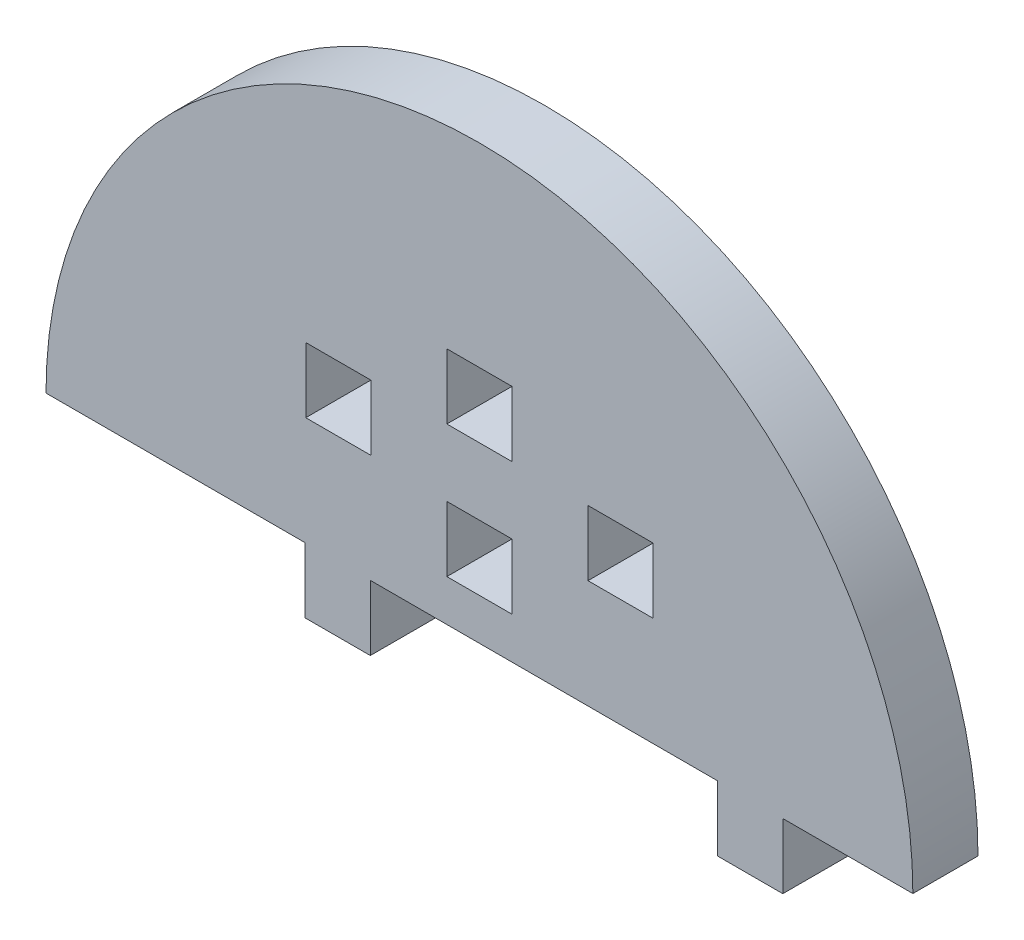
ISO-10303-21;
HEADER;
FILE_DESCRIPTION(('STEP AP214'),'2;1');
FILE_NAME('part.step','',(''),(''),'','','');
FILE_SCHEMA(('AUTOMOTIVE_DESIGN { 1 0 10303 214 1 1 1 1 }'));
ENDSEC;
DATA;
#1=APPLICATION_CONTEXT('core data for automotive mechanical design processes');
#2=APPLICATION_PROTOCOL_DEFINITION('international standard','automotive_design',2000,#1);
#3=PRODUCT_CONTEXT('',#1,'mechanical');
#4=PRODUCT('Part','Part','',(#3));
#5=PRODUCT_RELATED_PRODUCT_CATEGORY('part','',(#4));
#6=PRODUCT_DEFINITION_FORMATION('','',#4);
#7=PRODUCT_DEFINITION_CONTEXT('part definition',#1,'design');
#8=PRODUCT_DEFINITION('design','',#6,#7);
#9=PRODUCT_DEFINITION_SHAPE('','',#8);
#10=(LENGTH_UNIT() NAMED_UNIT(*) SI_UNIT(.MILLI.,.METRE.));
#11=(NAMED_UNIT(*) PLANE_ANGLE_UNIT() SI_UNIT($,.RADIAN.));
#12=(NAMED_UNIT(*) SI_UNIT($,.STERADIAN.) SOLID_ANGLE_UNIT());
#13=UNCERTAINTY_MEASURE_WITH_UNIT(LENGTH_MEASURE(1.E-05),#10,'distance_accuracy_value','');
#14=(GEOMETRIC_REPRESENTATION_CONTEXT(3) GLOBAL_UNCERTAINTY_ASSIGNED_CONTEXT((#13)) GLOBAL_UNIT_ASSIGNED_CONTEXT((#10,
#11,#12)) REPRESENTATION_CONTEXT('',''));
#15=CARTESIAN_POINT('',(0.,0.,0.));
#16=DIRECTION('',(0.,0.,1.));
#17=DIRECTION('',(1.,0.,0.));
#18=AXIS2_PLACEMENT_3D('',#15,#16,#17);
#19=CARTESIAN_POINT('',(3528.3356839371,1061.74894743644,6.));
#20=DIRECTION('',(0.,0.,1.));
#21=DIRECTION('',(1.,0.,0.));
#22=AXIS2_PLACEMENT_3D('',#19,#20,#21);
#23=PLANE('',#22);
#24=DIRECTION('',(0.,1.,0.));
#25=VECTOR('',#24,1.);
#26=CARTESIAN_POINT('',(3538.3356839371,0.,6.));
#27=LINE('',#26,#25);
#28=CARTESIAN_POINT('',(3538.3356839371,1071.74894743644,6.));
#29=VERTEX_POINT('',#28);
#30=CARTESIAN_POINT('',(3538.3356839371,1077.74894743644,6.));
#31=VERTEX_POINT('',#30);
#32=EDGE_CURVE('E429',#29,#31,#27,.T.);
#33=ORIENTED_EDGE('',*,*,#32,.T.);
#34=DIRECTION('',(1.,0.,0.));
#35=VECTOR('',#34,1.);
#36=CARTESIAN_POINT('',(0.,1077.74894743644,6.));
#37=LINE('',#36,#35);
#38=CARTESIAN_POINT('',(3544.3356839371,1077.74894743644,6.));
#39=VERTEX_POINT('',#38);
#40=EDGE_CURVE('E442',#31,#39,#37,.T.);
#41=ORIENTED_EDGE('',*,*,#40,.T.);
#42=DIRECTION('',(0.,-1.,0.));
#43=VECTOR('',#42,1.);
#44=CARTESIAN_POINT('',(3544.3356839371,0.,6.));
#45=LINE('',#44,#43);
#46=CARTESIAN_POINT('',(3544.3356839371,1071.74894743644,6.));
#47=VERTEX_POINT('',#46);
#48=EDGE_CURVE('E438',#39,#47,#45,.T.);
#49=ORIENTED_EDGE('',*,*,#48,.T.);
#50=DIRECTION('',(-1.,0.,0.));
#51=VECTOR('',#50,1.);
#52=CARTESIAN_POINT('',(0.,1071.74894743644,6.));
#53=LINE('',#52,#51);
#54=EDGE_CURVE('E433',#47,#29,#53,.T.);
#55=ORIENTED_EDGE('',*,*,#54,.T.);
#56=EDGE_LOOP('',(#33,#41,#49,#55));
#57=FACE_BOUND('',#56,.T.);
#58=DIRECTION('',(0.,1.,0.));
#59=VECTOR('',#58,1.);
#60=CARTESIAN_POINT('',(3525.3356839371,0.,6.));
#61=LINE('',#60,#59);
#62=CARTESIAN_POINT('',(3525.3356839371,1077.74894743644,6.));
#63=VERTEX_POINT('',#62);
#64=CARTESIAN_POINT('',(3525.3356839371,1083.74894743644,6.));
#65=VERTEX_POINT('',#64);
#66=EDGE_CURVE('E516',#63,#65,#61,.T.);
#67=ORIENTED_EDGE('',*,*,#66,.T.);
#68=DIRECTION('',(1.,0.,0.));
#69=VECTOR('',#68,1.);
#70=CARTESIAN_POINT('',(0.,1083.74894743644,6.));
#71=LINE('',#70,#69);
#72=CARTESIAN_POINT('',(3531.3356839371,1083.74894743644,6.));
#73=VERTEX_POINT('',#72);
#74=EDGE_CURVE('E529',#65,#73,#71,.T.);
#75=ORIENTED_EDGE('',*,*,#74,.T.);
#76=DIRECTION('',(0.,-1.,0.));
#77=VECTOR('',#76,1.);
#78=CARTESIAN_POINT('',(3531.3356839371,0.,6.));
#79=LINE('',#78,#77);
#80=CARTESIAN_POINT('',(3531.3356839371,1077.74894743644,6.));
#81=VERTEX_POINT('',#80);
#82=EDGE_CURVE('E525',#73,#81,#79,.T.);
#83=ORIENTED_EDGE('',*,*,#82,.T.);
#84=DIRECTION('',(-1.,0.,0.));
#85=VECTOR('',#84,1.);
#86=CARTESIAN_POINT('',(0.,1077.74894743644,6.));
#87=LINE('',#86,#85);
#88=EDGE_CURVE('E520',#81,#63,#87,.T.);
#89=ORIENTED_EDGE('',*,*,#88,.T.);
#90=EDGE_LOOP('',(#67,#75,#83,#89));
#91=FACE_BOUND('',#90,.T.);
#92=DIRECTION('',(1.,0.,0.));
#93=VECTOR('',#92,1.);
#94=CARTESIAN_POINT('',(3556.28431890895,1061.74894743644,6.));
#95=LINE('',#94,#93);
#96=CARTESIAN_POINT('',(3556.28431890895,1061.74894743644,6.));
#97=VERTEX_POINT('',#96);
#98=CARTESIAN_POINT('',(3568.26425536569,1061.74894743644,6.));
#99=VERTEX_POINT('',#98);
#100=EDGE_CURVE('E560',#97,#99,#95,.T.);
#101=ORIENTED_EDGE('',*,*,#100,.T.);
#102=CARTESIAN_POINT('',(3528.3356839371,1061.74894743644,6.));
#103=DIRECTION('',(0.,0.,1.));
#104=DIRECTION('',(1.,0.,0.));
#105=AXIS2_PLACEMENT_3D('',#102,#103,#104);
#106=CIRCLE('',#105,39.9285714285824);
#107=CARTESIAN_POINT('',(3488.40711250852,1061.74894743644,6.));
#108=VERTEX_POINT('',#107);
#109=EDGE_CURVE('E564',#99,#108,#106,.T.);
#110=ORIENTED_EDGE('',*,*,#109,.T.);
#111=DIRECTION('',(1.,0.,0.));
#112=VECTOR('',#111,1.);
#113=CARTESIAN_POINT('',(3488.40711250852,1061.74894743644,6.));
#114=LINE('',#113,#112);
#115=CARTESIAN_POINT('',(3512.28431890895,1061.74894743644,6.));
#116=VERTEX_POINT('',#115);
#117=EDGE_CURVE('E568',#108,#116,#114,.T.);
#118=ORIENTED_EDGE('',*,*,#117,.T.);
#119=DIRECTION('',(0.,1.,0.));
#120=VECTOR('',#119,1.);
#121=CARTESIAN_POINT('',(3512.28431890895,1055.74894743644,6.));
#122=LINE('',#121,#120);
#123=CARTESIAN_POINT('',(3512.28431890895,1055.74894743644,6.));
#124=VERTEX_POINT('',#123);
#125=EDGE_CURVE('E571',#124,#116,#122,.T.);
#126=ORIENTED_EDGE('',*,*,#125,.F.);
#127=DIRECTION('',(-1.,0.,0.));
#128=VECTOR('',#127,1.);
#129=CARTESIAN_POINT('',(3518.28431890895,1055.74894743644,6.));
#130=LINE('',#129,#128);
#131=CARTESIAN_POINT('',(3518.28431890895,1055.74894743644,6.));
#132=VERTEX_POINT('',#131);
#133=EDGE_CURVE('E575',#132,#124,#130,.T.);
#134=ORIENTED_EDGE('',*,*,#133,.F.);
#135=DIRECTION('',(0.,-1.,0.));
#136=VECTOR('',#135,1.);
#137=CARTESIAN_POINT('',(3518.28431890895,1061.74894743644,6.));
#138=LINE('',#137,#136);
#139=CARTESIAN_POINT('',(3518.28431890895,1061.74894743644,6.));
#140=VERTEX_POINT('',#139);
#141=EDGE_CURVE('E579',#140,#132,#138,.T.);
#142=ORIENTED_EDGE('',*,*,#141,.F.);
#143=DIRECTION('',(1.,0.,0.));
#144=VECTOR('',#143,1.);
#145=CARTESIAN_POINT('',(3518.28431890895,1061.74894743644,6.));
#146=LINE('',#145,#144);
#147=CARTESIAN_POINT('',(3550.28431890895,1061.74894743644,6.));
#148=VERTEX_POINT('',#147);
#149=EDGE_CURVE('E583',#140,#148,#146,.T.);
#150=ORIENTED_EDGE('',*,*,#149,.T.);
#151=DIRECTION('',(0.,-1.,0.));
#152=VECTOR('',#151,1.);
#153=CARTESIAN_POINT('',(3550.28431890895,1061.74894743644,6.));
#154=LINE('',#153,#152);
#155=CARTESIAN_POINT('',(3550.28431890895,1055.74894743644,6.));
#156=VERTEX_POINT('',#155);
#157=EDGE_CURVE('E586',#148,#156,#154,.T.);
#158=ORIENTED_EDGE('',*,*,#157,.T.);
#159=DIRECTION('',(1.,0.,0.));
#160=VECTOR('',#159,1.);
#161=CARTESIAN_POINT('',(3550.28431890895,1055.74894743644,6.));
#162=LINE('',#161,#160);
#163=CARTESIAN_POINT('',(3556.28431890895,1055.74894743644,6.));
#164=VERTEX_POINT('',#163);
#165=EDGE_CURVE('E589',#156,#164,#162,.T.);
#166=ORIENTED_EDGE('',*,*,#165,.T.);
#167=DIRECTION('',(0.,1.,0.));
#168=VECTOR('',#167,1.);
#169=CARTESIAN_POINT('',(3556.28431890895,1055.74894743644,6.));
#170=LINE('',#169,#168);
#171=EDGE_CURVE('E592',#164,#97,#170,.T.);
#172=ORIENTED_EDGE('',*,*,#171,.T.);
#173=EDGE_LOOP('',(#101,#110,#118,#126,#134,#142,#150,#158,#166,#172));
#174=FACE_BOUND('',#173,.T.);
#175=DIRECTION('',(0.,-1.,0.));
#176=VECTOR('',#175,1.);
#177=CARTESIAN_POINT('',(3525.3356839371,0.,6.));
#178=LINE('',#177,#176);
#179=CARTESIAN_POINT('',(3525.3356839371,1071.57340626986,6.));
#180=VERTEX_POINT('',#179);
#181=CARTESIAN_POINT('',(3525.3356839371,1065.57340626986,6.));
#182=VERTEX_POINT('',#181);
#183=EDGE_CURVE('E476',#180,#182,#178,.T.);
#184=ORIENTED_EDGE('',*,*,#183,.F.);
#185=DIRECTION('',(-1.,0.,0.));
#186=VECTOR('',#185,1.);
#187=CARTESIAN_POINT('',(0.,1071.57340626986,6.));
#188=LINE('',#187,#186);
#189=CARTESIAN_POINT('',(3531.3356839371,1071.57340626986,6.));
#190=VERTEX_POINT('',#189);
#191=EDGE_CURVE('E473',#190,#180,#188,.T.);
#192=ORIENTED_EDGE('',*,*,#191,.F.);
#193=DIRECTION('',(0.,1.,0.));
#194=VECTOR('',#193,1.);
#195=CARTESIAN_POINT('',(3531.3356839371,0.,6.));
#196=LINE('',#195,#194);
#197=CARTESIAN_POINT('',(3531.3356839371,1065.57340626986,6.));
#198=VERTEX_POINT('',#197);
#199=EDGE_CURVE('E484',#198,#190,#196,.T.);
#200=ORIENTED_EDGE('',*,*,#199,.F.);
#201=DIRECTION('',(1.,0.,0.));
#202=VECTOR('',#201,1.);
#203=CARTESIAN_POINT('',(0.,1065.57340626986,6.));
#204=LINE('',#203,#202);
#205=EDGE_CURVE('E480',#182,#198,#204,.T.);
#206=ORIENTED_EDGE('',*,*,#205,.F.);
#207=EDGE_LOOP('',(#184,#192,#200,#206));
#208=FACE_BOUND('',#207,.T.);
#209=DIRECTION('',(0.,-1.,0.));
#210=VECTOR('',#209,1.);
#211=CARTESIAN_POINT('',(3512.3356839371,1077.74894743644,6.));
#212=LINE('',#211,#210);
#213=CARTESIAN_POINT('',(3512.3356839371,1077.74894743644,6.));
#214=VERTEX_POINT('',#213);
#215=CARTESIAN_POINT('',(3512.3356839371,1071.74894743644,6.));
#216=VERTEX_POINT('',#215);
#217=EDGE_CURVE('E390',#214,#216,#212,.T.);
#218=ORIENTED_EDGE('',*,*,#217,.F.);
#219=DIRECTION('',(-1.,0.,0.));
#220=VECTOR('',#219,1.);
#221=CARTESIAN_POINT('',(3518.3356839371,1077.74894743644,6.));
#222=LINE('',#221,#220);
#223=CARTESIAN_POINT('',(3518.3356839371,1077.74894743644,6.));
#224=VERTEX_POINT('',#223);
#225=EDGE_CURVE('E381',#224,#214,#222,.T.);
#226=ORIENTED_EDGE('',*,*,#225,.F.);
#227=DIRECTION('',(0.,1.,0.));
#228=VECTOR('',#227,1.);
#229=CARTESIAN_POINT('',(3518.3356839371,1071.74894743644,6.));
#230=LINE('',#229,#228);
#231=CARTESIAN_POINT('',(3518.3356839371,1071.74894743644,6.));
#232=VERTEX_POINT('',#231);
#233=EDGE_CURVE('E407',#232,#224,#230,.T.);
#234=ORIENTED_EDGE('',*,*,#233,.F.);
#235=DIRECTION('',(1.,0.,0.));
#236=VECTOR('',#235,1.);
#237=CARTESIAN_POINT('',(3512.3356839371,1071.74894743644,6.));
#238=LINE('',#237,#236);
#239=EDGE_CURVE('E403',#216,#232,#238,.T.);
#240=ORIENTED_EDGE('',*,*,#239,.F.);
#241=EDGE_LOOP('',(#218,#226,#234,#240));
#242=FACE_BOUND('',#241,.T.);
#243=ADVANCED_FACE('F207',(#57,#91,#174,#208,#242),#23,.T.);
#244=CARTESIAN_POINT('',(3528.3356839371,1061.74894743644,0.));
#245=DIRECTION('',(0.,0.,1.));
#246=DIRECTION('',(1.,0.,0.));
#247=AXIS2_PLACEMENT_3D('',#244,#245,#246);
#248=PLANE('',#247);
#249=DIRECTION('',(-1.,0.,0.));
#250=VECTOR('',#249,1.);
#251=CARTESIAN_POINT('',(0.,1071.57340626986,0.));
#252=LINE('',#251,#250);
#253=CARTESIAN_POINT('',(3531.3356839371,1071.57340626986,0.));
#254=VERTEX_POINT('',#253);
#255=CARTESIAN_POINT('',(3525.3356839371,1071.57340626986,0.));
#256=VERTEX_POINT('',#255);
#257=EDGE_CURVE('E472',#254,#256,#252,.T.);
#258=ORIENTED_EDGE('',*,*,#257,.T.);
#259=DIRECTION('',(0.,-1.,0.));
#260=VECTOR('',#259,1.);
#261=CARTESIAN_POINT('',(3525.3356839371,0.,0.));
#262=LINE('',#261,#260);
#263=CARTESIAN_POINT('',(3525.3356839371,1065.57340626986,0.));
#264=VERTEX_POINT('',#263);
#265=EDGE_CURVE('E491',#256,#264,#262,.T.);
#266=ORIENTED_EDGE('',*,*,#265,.T.);
#267=DIRECTION('',(1.,0.,0.));
#268=VECTOR('',#267,1.);
#269=CARTESIAN_POINT('',(0.,1065.57340626986,0.));
#270=LINE('',#269,#268);
#271=CARTESIAN_POINT('',(3531.3356839371,1065.57340626986,0.));
#272=VERTEX_POINT('',#271);
#273=EDGE_CURVE('E495',#264,#272,#270,.T.);
#274=ORIENTED_EDGE('',*,*,#273,.T.);
#275=DIRECTION('',(0.,1.,0.));
#276=VECTOR('',#275,1.);
#277=CARTESIAN_POINT('',(3531.3356839371,0.,0.));
#278=LINE('',#277,#276);
#279=EDGE_CURVE('E477',#272,#254,#278,.T.);
#280=ORIENTED_EDGE('',*,*,#279,.T.);
#281=EDGE_LOOP('',(#258,#266,#274,#280));
#282=FACE_BOUND('',#281,.T.);
#283=DIRECTION('',(1.,0.,0.));
#284=VECTOR('',#283,1.);
#285=CARTESIAN_POINT('',(0.,1083.74894743644,0.));
#286=LINE('',#285,#284);
#287=CARTESIAN_POINT('',(3525.3356839371,1083.74894743644,0.));
#288=VERTEX_POINT('',#287);
#289=CARTESIAN_POINT('',(3531.3356839371,1083.74894743644,0.));
#290=VERTEX_POINT('',#289);
#291=EDGE_CURVE('E521',#288,#290,#286,.T.);
#292=ORIENTED_EDGE('',*,*,#291,.F.);
#293=DIRECTION('',(0.,1.,0.));
#294=VECTOR('',#293,1.);
#295=CARTESIAN_POINT('',(3525.3356839371,0.,0.));
#296=LINE('',#295,#294);
#297=CARTESIAN_POINT('',(3525.3356839371,1077.74894743644,0.));
#298=VERTEX_POINT('',#297);
#299=EDGE_CURVE('E515',#298,#288,#296,.T.);
#300=ORIENTED_EDGE('',*,*,#299,.F.);
#301=DIRECTION('',(-1.,0.,0.));
#302=VECTOR('',#301,1.);
#303=CARTESIAN_POINT('',(0.,1077.74894743644,0.));
#304=LINE('',#303,#302);
#305=CARTESIAN_POINT('',(3531.3356839371,1077.74894743644,0.));
#306=VERTEX_POINT('',#305);
#307=EDGE_CURVE('E536',#306,#298,#304,.T.);
#308=ORIENTED_EDGE('',*,*,#307,.F.);
#309=DIRECTION('',(0.,-1.,0.));
#310=VECTOR('',#309,1.);
#311=CARTESIAN_POINT('',(3531.3356839371,0.,0.));
#312=LINE('',#311,#310);
#313=EDGE_CURVE('E540',#290,#306,#312,.T.);
#314=ORIENTED_EDGE('',*,*,#313,.F.);
#315=EDGE_LOOP('',(#292,#300,#308,#314));
#316=FACE_BOUND('',#315,.T.);
#317=DIRECTION('',(1.,0.,0.));
#318=VECTOR('',#317,1.);
#319=CARTESIAN_POINT('',(3556.28431890895,1061.74894743644,0.));
#320=LINE('',#319,#318);
#321=CARTESIAN_POINT('',(3556.28431890895,1061.74894743644,0.));
#322=VERTEX_POINT('',#321);
#323=CARTESIAN_POINT('',(3568.26425536569,1061.74894743644,0.));
#324=VERTEX_POINT('',#323);
#325=EDGE_CURVE('E559',#322,#324,#320,.T.);
#326=ORIENTED_EDGE('',*,*,#325,.F.);
#327=DIRECTION('',(0.,1.,0.));
#328=VECTOR('',#327,1.);
#329=CARTESIAN_POINT('',(3556.28431890895,1055.74894743644,0.));
#330=LINE('',#329,#328);
#331=CARTESIAN_POINT('',(3556.28431890895,1055.74894743644,0.));
#332=VERTEX_POINT('',#331);
#333=EDGE_CURVE('E565',#332,#322,#330,.T.);
#334=ORIENTED_EDGE('',*,*,#333,.F.);
#335=DIRECTION('',(1.,0.,0.));
#336=VECTOR('',#335,1.);
#337=CARTESIAN_POINT('',(3550.28431890895,1055.74894743644,0.));
#338=LINE('',#337,#336);
#339=CARTESIAN_POINT('',(3550.28431890895,1055.74894743644,0.));
#340=VERTEX_POINT('',#339);
#341=EDGE_CURVE('E624',#340,#332,#338,.T.);
#342=ORIENTED_EDGE('',*,*,#341,.F.);
#343=DIRECTION('',(0.,-1.,0.));
#344=VECTOR('',#343,1.);
#345=CARTESIAN_POINT('',(3550.28431890895,1061.74894743644,0.));
#346=LINE('',#345,#344);
#347=CARTESIAN_POINT('',(3550.28431890895,1061.74894743644,0.));
#348=VERTEX_POINT('',#347);
#349=EDGE_CURVE('E621',#348,#340,#346,.T.);
#350=ORIENTED_EDGE('',*,*,#349,.F.);
#351=DIRECTION('',(1.,0.,0.));
#352=VECTOR('',#351,1.);
#353=CARTESIAN_POINT('',(3518.28431890895,1061.74894743644,0.));
#354=LINE('',#353,#352);
#355=CARTESIAN_POINT('',(3518.28431890895,1061.74894743644,0.));
#356=VERTEX_POINT('',#355);
#357=EDGE_CURVE('E618',#356,#348,#354,.T.);
#358=ORIENTED_EDGE('',*,*,#357,.F.);
#359=DIRECTION('',(0.,-1.,0.));
#360=VECTOR('',#359,1.);
#361=CARTESIAN_POINT('',(3518.28431890895,1061.74894743644,0.));
#362=LINE('',#361,#360);
#363=CARTESIAN_POINT('',(3518.28431890895,1055.74894743644,0.));
#364=VERTEX_POINT('',#363);
#365=EDGE_CURVE('E614',#356,#364,#362,.T.);
#366=ORIENTED_EDGE('',*,*,#365,.T.);
#367=DIRECTION('',(-1.,0.,0.));
#368=VECTOR('',#367,1.);
#369=CARTESIAN_POINT('',(3518.28431890895,1055.74894743644,0.));
#370=LINE('',#369,#368);
#371=CARTESIAN_POINT('',(3512.28431890895,1055.74894743644,0.));
#372=VERTEX_POINT('',#371);
#373=EDGE_CURVE('E610',#364,#372,#370,.T.);
#374=ORIENTED_EDGE('',*,*,#373,.T.);
#375=DIRECTION('',(0.,1.,0.));
#376=VECTOR('',#375,1.);
#377=CARTESIAN_POINT('',(3512.28431890895,1055.74894743644,0.));
#378=LINE('',#377,#376);
#379=CARTESIAN_POINT('',(3512.28431890895,1061.74894743644,0.));
#380=VERTEX_POINT('',#379);
#381=EDGE_CURVE('E606',#372,#380,#378,.T.);
#382=ORIENTED_EDGE('',*,*,#381,.T.);
#383=DIRECTION('',(1.,0.,0.));
#384=VECTOR('',#383,1.);
#385=CARTESIAN_POINT('',(3488.40711250852,1061.74894743644,0.));
#386=LINE('',#385,#384);
#387=CARTESIAN_POINT('',(3488.40711250852,1061.74894743644,0.));
#388=VERTEX_POINT('',#387);
#389=EDGE_CURVE('E602',#388,#380,#386,.T.);
#390=ORIENTED_EDGE('',*,*,#389,.F.);
#391=CARTESIAN_POINT('',(3528.3356839371,1061.74894743644,0.));
#392=DIRECTION('',(0.,0.,1.));
#393=DIRECTION('',(1.,0.,0.));
#394=AXIS2_PLACEMENT_3D('',#391,#392,#393);
#395=CIRCLE('',#394,39.9285714285824);
#396=EDGE_CURVE('E599',#324,#388,#395,.T.);
#397=ORIENTED_EDGE('',*,*,#396,.F.);
#398=EDGE_LOOP('',(#326,#334,#342,#350,#358,#366,#374,#382,#390,#397));
#399=FACE_BOUND('',#398,.T.);
#400=DIRECTION('',(1.,0.,0.));
#401=VECTOR('',#400,1.);
#402=CARTESIAN_POINT('',(0.,1077.74894743644,0.));
#403=LINE('',#402,#401);
#404=CARTESIAN_POINT('',(3538.3356839371,1077.74894743644,0.));
#405=VERTEX_POINT('',#404);
#406=CARTESIAN_POINT('',(3544.3356839371,1077.74894743644,0.));
#407=VERTEX_POINT('',#406);
#408=EDGE_CURVE('E434',#405,#407,#403,.T.);
#409=ORIENTED_EDGE('',*,*,#408,.F.);
#410=DIRECTION('',(0.,1.,0.));
#411=VECTOR('',#410,1.);
#412=CARTESIAN_POINT('',(3538.3356839371,0.,0.));
#413=LINE('',#412,#411);
#414=CARTESIAN_POINT('',(3538.3356839371,1071.74894743644,0.));
#415=VERTEX_POINT('',#414);
#416=EDGE_CURVE('E399',#415,#405,#413,.T.);
#417=ORIENTED_EDGE('',*,*,#416,.F.);
#418=DIRECTION('',(-1.,0.,0.));
#419=VECTOR('',#418,1.);
#420=CARTESIAN_POINT('',(0.,1071.74894743644,0.));
#421=LINE('',#420,#419);
#422=CARTESIAN_POINT('',(3544.3356839371,1071.74894743644,0.));
#423=VERTEX_POINT('',#422);
#424=EDGE_CURVE('E449',#423,#415,#421,.T.);
#425=ORIENTED_EDGE('',*,*,#424,.F.);
#426=DIRECTION('',(0.,-1.,0.));
#427=VECTOR('',#426,1.);
#428=CARTESIAN_POINT('',(3544.3356839371,0.,0.));
#429=LINE('',#428,#427);
#430=EDGE_CURVE('E453',#407,#423,#429,.T.);
#431=ORIENTED_EDGE('',*,*,#430,.F.);
#432=EDGE_LOOP('',(#409,#417,#425,#431));
#433=FACE_BOUND('',#432,.T.);
#434=DIRECTION('',(-1.,0.,0.));
#435=VECTOR('',#434,1.);
#436=CARTESIAN_POINT('',(3518.3356839371,1077.74894743644,0.));
#437=LINE('',#436,#435);
#438=CARTESIAN_POINT('',(3518.3356839371,1077.74894743644,0.));
#439=VERTEX_POINT('',#438);
#440=CARTESIAN_POINT('',(3512.3356839371,1077.74894743644,0.));
#441=VERTEX_POINT('',#440);
#442=EDGE_CURVE('E231',#439,#441,#437,.T.);
#443=ORIENTED_EDGE('',*,*,#442,.T.);
#444=DIRECTION('',(0.,-1.,0.));
#445=VECTOR('',#444,1.);
#446=CARTESIAN_POINT('',(3512.3356839371,1077.74894743644,0.));
#447=LINE('',#446,#445);
#448=CARTESIAN_POINT('',(3512.3356839371,1071.74894743644,0.));
#449=VERTEX_POINT('',#448);
#450=EDGE_CURVE('E397',#441,#449,#447,.T.);
#451=ORIENTED_EDGE('',*,*,#450,.T.);
#452=DIRECTION('',(1.,0.,0.));
#453=VECTOR('',#452,1.);
#454=CARTESIAN_POINT('',(3512.3356839371,1071.74894743644,0.));
#455=LINE('',#454,#453);
#456=CARTESIAN_POINT('',(3518.3356839371,1071.74894743644,0.));
#457=VERTEX_POINT('',#456);
#458=EDGE_CURVE('E416',#449,#457,#455,.T.);
#459=ORIENTED_EDGE('',*,*,#458,.T.);
#460=DIRECTION('',(0.,1.,0.));
#461=VECTOR('',#460,1.);
#462=CARTESIAN_POINT('',(3518.3356839371,1071.74894743644,0.));
#463=LINE('',#462,#461);
#464=EDGE_CURVE('E391',#457,#439,#463,.T.);
#465=ORIENTED_EDGE('',*,*,#464,.T.);
#466=EDGE_LOOP('',(#443,#451,#459,#465));
#467=FACE_BOUND('',#466,.T.);
#468=ADVANCED_FACE('F666',(#282,#316,#399,#433,#467),#248,.F.);
#469=CARTESIAN_POINT('',(3556.28431890895,1061.74894743644,6.));
#470=DIRECTION('',(0.,1.,0.));
#471=DIRECTION('',(0.,0.,1.));
#472=AXIS2_PLACEMENT_3D('',#469,#470,#471);
#473=PLANE('',#472);
#474=ORIENTED_EDGE('',*,*,#325,.T.);
#475=DIRECTION('',(0.,0.,-1.));
#476=VECTOR('',#475,1.);
#477=CARTESIAN_POINT('',(3568.26425536569,1061.74894743644,6.));
#478=LINE('',#477,#476);
#479=EDGE_CURVE('E12',#99,#324,#478,.T.);
#480=ORIENTED_EDGE('',*,*,#479,.F.);
#481=ORIENTED_EDGE('',*,*,#100,.F.);
#482=DIRECTION('',(0.,0.,-1.));
#483=VECTOR('',#482,1.);
#484=CARTESIAN_POINT('',(3556.28431890895,1061.74894743644,6.));
#485=LINE('',#484,#483);
#486=EDGE_CURVE('E595',#97,#322,#485,.T.);
#487=ORIENTED_EDGE('',*,*,#486,.T.);
#488=EDGE_LOOP('',(#474,#480,#481,#487));
#489=FACE_BOUND('',#488,.T.);
#490=ADVANCED_FACE('F209',(#489),#473,.F.);
#491=CARTESIAN_POINT('',(3528.3356839371,1061.74894743644,6.));
#492=DIRECTION('',(0.,0.,-1.));
#493=DIRECTION('',(-1.,0.,0.));
#494=AXIS2_PLACEMENT_3D('',#491,#492,#493);
#495=CYLINDRICAL_SURFACE('',#494,39.9285714285824);
#496=ORIENTED_EDGE('',*,*,#396,.T.);
#497=DIRECTION('',(0.,0.,-1.));
#498=VECTOR('',#497,1.);
#499=CARTESIAN_POINT('',(3488.40711250852,1061.74894743644,6.));
#500=LINE('',#499,#498);
#501=EDGE_CURVE('E216',#108,#388,#500,.T.);
#502=ORIENTED_EDGE('',*,*,#501,.F.);
#503=ORIENTED_EDGE('',*,*,#109,.F.);
#504=ORIENTED_EDGE('',*,*,#479,.T.);
#505=EDGE_LOOP('',(#496,#502,#503,#504));
#506=FACE_BOUND('',#505,.T.);
#507=ADVANCED_FACE('F705',(#506),#495,.T.);
#508=CARTESIAN_POINT('',(3488.40711250852,1061.74894743644,6.));
#509=DIRECTION('',(0.,1.,0.));
#510=DIRECTION('',(0.,0.,1.));
#511=AXIS2_PLACEMENT_3D('',#508,#509,#510);
#512=PLANE('',#511);
#513=ORIENTED_EDGE('',*,*,#389,.T.);
#514=DIRECTION('',(0.,0.,-1.));
#515=VECTOR('',#514,1.);
#516=CARTESIAN_POINT('',(3512.28431890895,1061.74894743644,6.));
#517=LINE('',#516,#515);
#518=EDGE_CURVE('E653',#116,#380,#517,.T.);
#519=ORIENTED_EDGE('',*,*,#518,.F.);
#520=ORIENTED_EDGE('',*,*,#117,.F.);
#521=ORIENTED_EDGE('',*,*,#501,.T.);
#522=EDGE_LOOP('',(#513,#519,#520,#521));
#523=FACE_BOUND('',#522,.T.);
#524=ADVANCED_FACE('F661',(#523),#512,.F.);
#525=CARTESIAN_POINT('',(3512.28431890895,1055.74894743644,6.));
#526=DIRECTION('',(-1.,0.,0.));
#527=DIRECTION('',(0.,0.,1.));
#528=AXIS2_PLACEMENT_3D('',#525,#526,#527);
#529=PLANE('',#528);
#530=ORIENTED_EDGE('',*,*,#381,.F.);
#531=DIRECTION('',(0.,0.,-1.));
#532=VECTOR('',#531,1.);
#533=CARTESIAN_POINT('',(3512.28431890895,1055.74894743644,6.));
#534=LINE('',#533,#532);
#535=EDGE_CURVE('E650',#124,#372,#534,.T.);
#536=ORIENTED_EDGE('',*,*,#535,.F.);
#537=ORIENTED_EDGE('',*,*,#125,.T.);
#538=ORIENTED_EDGE('',*,*,#518,.T.);
#539=EDGE_LOOP('',(#530,#536,#537,#538));
#540=FACE_BOUND('',#539,.T.);
#541=ADVANCED_FACE('F671',(#540),#529,.T.);
#542=CARTESIAN_POINT('',(3518.28431890895,1055.74894743644,6.));
#543=DIRECTION('',(0.,-1.,0.));
#544=DIRECTION('',(0.,0.,-1.));
#545=AXIS2_PLACEMENT_3D('',#542,#543,#544);
#546=PLANE('',#545);
#547=ORIENTED_EDGE('',*,*,#373,.F.);
#548=DIRECTION('',(0.,0.,-1.));
#549=VECTOR('',#548,1.);
#550=CARTESIAN_POINT('',(3518.28431890895,1055.74894743644,6.));
#551=LINE('',#550,#549);
#552=EDGE_CURVE('E647',#132,#364,#551,.T.);
#553=ORIENTED_EDGE('',*,*,#552,.F.);
#554=ORIENTED_EDGE('',*,*,#133,.T.);
#555=ORIENTED_EDGE('',*,*,#535,.T.);
#556=EDGE_LOOP('',(#547,#553,#554,#555));
#557=FACE_BOUND('',#556,.T.);
#558=ADVANCED_FACE('F678',(#557),#546,.T.);
#559=CARTESIAN_POINT('',(3518.28431890895,1061.74894743644,6.));
#560=DIRECTION('',(1.,0.,0.));
#561=DIRECTION('',(0.,0.,-1.));
#562=AXIS2_PLACEMENT_3D('',#559,#560,#561);
#563=PLANE('',#562);
#564=ORIENTED_EDGE('',*,*,#365,.F.);
#565=DIRECTION('',(0.,0.,-1.));
#566=VECTOR('',#565,1.);
#567=CARTESIAN_POINT('',(3518.28431890895,1061.74894743644,6.));
#568=LINE('',#567,#566);
#569=EDGE_CURVE('E644',#140,#356,#568,.T.);
#570=ORIENTED_EDGE('',*,*,#569,.F.);
#571=ORIENTED_EDGE('',*,*,#141,.T.);
#572=ORIENTED_EDGE('',*,*,#552,.T.);
#573=EDGE_LOOP('',(#564,#570,#571,#572));
#574=FACE_BOUND('',#573,.T.);
#575=ADVANCED_FACE('F681',(#574),#563,.T.);
#576=CARTESIAN_POINT('',(3518.28431890895,1061.74894743644,6.));
#577=DIRECTION('',(0.,1.,0.));
#578=DIRECTION('',(0.,0.,1.));
#579=AXIS2_PLACEMENT_3D('',#576,#577,#578);
#580=PLANE('',#579);
#581=ORIENTED_EDGE('',*,*,#357,.T.);
#582=DIRECTION('',(0.,0.,-1.));
#583=VECTOR('',#582,1.);
#584=CARTESIAN_POINT('',(3550.28431890895,1061.74894743644,6.));
#585=LINE('',#584,#583);
#586=EDGE_CURVE('E640',#148,#348,#585,.T.);
#587=ORIENTED_EDGE('',*,*,#586,.F.);
#588=ORIENTED_EDGE('',*,*,#149,.F.);
#589=ORIENTED_EDGE('',*,*,#569,.T.);
#590=EDGE_LOOP('',(#581,#587,#588,#589));
#591=FACE_BOUND('',#590,.T.);
#592=ADVANCED_FACE('F687',(#591),#580,.F.);
#593=CARTESIAN_POINT('',(3550.28431890895,1061.74894743644,6.));
#594=DIRECTION('',(1.,0.,0.));
#595=DIRECTION('',(0.,0.,-1.));
#596=AXIS2_PLACEMENT_3D('',#593,#594,#595);
#597=PLANE('',#596);
#598=ORIENTED_EDGE('',*,*,#349,.T.);
#599=DIRECTION('',(0.,0.,-1.));
#600=VECTOR('',#599,1.);
#601=CARTESIAN_POINT('',(3550.28431890895,1055.74894743644,6.));
#602=LINE('',#601,#600);
#603=EDGE_CURVE('E636',#156,#340,#602,.T.);
#604=ORIENTED_EDGE('',*,*,#603,.F.);
#605=ORIENTED_EDGE('',*,*,#157,.F.);
#606=ORIENTED_EDGE('',*,*,#586,.T.);
#607=EDGE_LOOP('',(#598,#604,#605,#606));
#608=FACE_BOUND('',#607,.T.);
#609=ADVANCED_FACE('F691',(#608),#597,.F.);
#610=CARTESIAN_POINT('',(3550.28431890895,1055.74894743644,6.));
#611=DIRECTION('',(0.,1.,0.));
#612=DIRECTION('',(0.,0.,1.));
#613=AXIS2_PLACEMENT_3D('',#610,#611,#612);
#614=PLANE('',#613);
#615=ORIENTED_EDGE('',*,*,#341,.T.);
#616=DIRECTION('',(0.,0.,-1.));
#617=VECTOR('',#616,1.);
#618=CARTESIAN_POINT('',(3556.28431890895,1055.74894743644,6.));
#619=LINE('',#618,#617);
#620=EDGE_CURVE('E632',#164,#332,#619,.T.);
#621=ORIENTED_EDGE('',*,*,#620,.F.);
#622=ORIENTED_EDGE('',*,*,#165,.F.);
#623=ORIENTED_EDGE('',*,*,#603,.T.);
#624=EDGE_LOOP('',(#615,#621,#622,#623));
#625=FACE_BOUND('',#624,.T.);
#626=ADVANCED_FACE('F696',(#625),#614,.F.);
#627=CARTESIAN_POINT('',(3556.28431890895,1055.74894743644,6.));
#628=DIRECTION('',(-1.,0.,0.));
#629=DIRECTION('',(0.,0.,1.));
#630=AXIS2_PLACEMENT_3D('',#627,#628,#629);
#631=PLANE('',#630);
#632=ORIENTED_EDGE('',*,*,#333,.T.);
#633=ORIENTED_EDGE('',*,*,#486,.F.);
#634=ORIENTED_EDGE('',*,*,#171,.F.);
#635=ORIENTED_EDGE('',*,*,#620,.T.);
#636=EDGE_LOOP('',(#632,#633,#634,#635));
#637=FACE_BOUND('',#636,.T.);
#638=ADVANCED_FACE('F702',(#637),#631,.F.);
#639=CARTESIAN_POINT('',(3525.3356839371,0.,6.));
#640=DIRECTION('',(-1.,0.,0.));
#641=DIRECTION('',(0.,0.,1.));
#642=AXIS2_PLACEMENT_3D('',#639,#640,#641);
#643=PLANE('',#642);
#644=ORIENTED_EDGE('',*,*,#299,.T.);
#645=DIRECTION('',(0.,0.,-1.));
#646=VECTOR('',#645,1.);
#647=CARTESIAN_POINT('',(3525.3356839371,1083.74894743644,6.));
#648=LINE('',#647,#646);
#649=EDGE_CURVE('E533',#65,#288,#648,.T.);
#650=ORIENTED_EDGE('',*,*,#649,.F.);
#651=ORIENTED_EDGE('',*,*,#66,.F.);
#652=DIRECTION('',(0.,0.,-1.));
#653=VECTOR('',#652,1.);
#654=CARTESIAN_POINT('',(3525.3356839371,1077.74894743644,6.));
#655=LINE('',#654,#653);
#656=EDGE_CURVE('E556',#63,#298,#655,.T.);
#657=ORIENTED_EDGE('',*,*,#656,.T.);
#658=EDGE_LOOP('',(#644,#650,#651,#657));
#659=FACE_BOUND('',#658,.T.);
#660=ADVANCED_FACE('F722',(#659),#643,.F.);
#661=CARTESIAN_POINT('',(0.,1077.74894743644,6.));
#662=DIRECTION('',(0.,-1.,0.));
#663=DIRECTION('',(0.,0.,-1.));
#664=AXIS2_PLACEMENT_3D('',#661,#662,#663);
#665=PLANE('',#664);
#666=ORIENTED_EDGE('',*,*,#307,.T.);
#667=ORIENTED_EDGE('',*,*,#656,.F.);
#668=ORIENTED_EDGE('',*,*,#88,.F.);
#669=DIRECTION('',(0.,0.,-1.));
#670=VECTOR('',#669,1.);
#671=CARTESIAN_POINT('',(3531.3356839371,1077.74894743644,6.));
#672=LINE('',#671,#670);
#673=EDGE_CURVE('E553',#81,#306,#672,.T.);
#674=ORIENTED_EDGE('',*,*,#673,.T.);
#675=EDGE_LOOP('',(#666,#667,#668,#674));
#676=FACE_BOUND('',#675,.T.);
#677=ADVANCED_FACE('F772',(#676),#665,.F.);
#678=CARTESIAN_POINT('',(3531.3356839371,0.,6.));
#679=DIRECTION('',(1.,0.,0.));
#680=DIRECTION('',(0.,0.,-1.));
#681=AXIS2_PLACEMENT_3D('',#678,#679,#680);
#682=PLANE('',#681);
#683=ORIENTED_EDGE('',*,*,#313,.T.);
#684=ORIENTED_EDGE('',*,*,#673,.F.);
#685=ORIENTED_EDGE('',*,*,#82,.F.);
#686=DIRECTION('',(0.,0.,-1.));
#687=VECTOR('',#686,1.);
#688=CARTESIAN_POINT('',(3531.3356839371,1083.74894743644,6.));
#689=LINE('',#688,#687);
#690=EDGE_CURVE('E550',#73,#290,#689,.T.);
#691=ORIENTED_EDGE('',*,*,#690,.T.);
#692=EDGE_LOOP('',(#683,#684,#685,#691));
#693=FACE_BOUND('',#692,.T.);
#694=ADVANCED_FACE('F779',(#693),#682,.F.);
#695=CARTESIAN_POINT('',(0.,1083.74894743644,6.));
#696=DIRECTION('',(0.,1.,0.));
#697=DIRECTION('',(0.,0.,1.));
#698=AXIS2_PLACEMENT_3D('',#695,#696,#697);
#699=PLANE('',#698);
#700=ORIENTED_EDGE('',*,*,#291,.T.);
#701=ORIENTED_EDGE('',*,*,#690,.F.);
#702=ORIENTED_EDGE('',*,*,#74,.F.);
#703=ORIENTED_EDGE('',*,*,#649,.T.);
#704=EDGE_LOOP('',(#700,#701,#702,#703));
#705=FACE_BOUND('',#704,.T.);
#706=ADVANCED_FACE('F786',(#705),#699,.F.);
#707=CARTESIAN_POINT('',(0.,1071.57340626986,6.));
#708=DIRECTION('',(0.,-1.,0.));
#709=DIRECTION('',(0.,0.,-1.));
#710=AXIS2_PLACEMENT_3D('',#707,#708,#709);
#711=PLANE('',#710);
#712=ORIENTED_EDGE('',*,*,#257,.F.);
#713=DIRECTION('',(0.,0.,-1.));
#714=VECTOR('',#713,1.);
#715=CARTESIAN_POINT('',(3531.3356839371,1071.57340626986,6.));
#716=LINE('',#715,#714);
#717=EDGE_CURVE('E487',#190,#254,#716,.T.);
#718=ORIENTED_EDGE('',*,*,#717,.F.);
#719=ORIENTED_EDGE('',*,*,#191,.T.);
#720=DIRECTION('',(0.,0.,-1.));
#721=VECTOR('',#720,1.);
#722=CARTESIAN_POINT('',(3525.3356839371,1071.57340626986,6.));
#723=LINE('',#722,#721);
#724=EDGE_CURVE('E511',#180,#256,#723,.T.);
#725=ORIENTED_EDGE('',*,*,#724,.T.);
#726=EDGE_LOOP('',(#712,#718,#719,#725));
#727=FACE_BOUND('',#726,.T.);
#728=ADVANCED_FACE('F794',(#727),#711,.T.);
#729=CARTESIAN_POINT('',(3525.3356839371,0.,6.));
#730=DIRECTION('',(1.,0.,0.));
#731=DIRECTION('',(0.,0.,-1.));
#732=AXIS2_PLACEMENT_3D('',#729,#730,#731);
#733=PLANE('',#732);
#734=ORIENTED_EDGE('',*,*,#265,.F.);
#735=ORIENTED_EDGE('',*,*,#724,.F.);
#736=ORIENTED_EDGE('',*,*,#183,.T.);
#737=DIRECTION('',(0.,0.,-1.));
#738=VECTOR('',#737,1.);
#739=CARTESIAN_POINT('',(3525.3356839371,1065.57340626986,6.));
#740=LINE('',#739,#738);
#741=EDGE_CURVE('E508',#182,#264,#740,.T.);
#742=ORIENTED_EDGE('',*,*,#741,.T.);
#743=EDGE_LOOP('',(#734,#735,#736,#742));
#744=FACE_BOUND('',#743,.T.);
#745=ADVANCED_FACE('F802',(#744),#733,.T.);
#746=CARTESIAN_POINT('',(0.,1065.57340626986,6.));
#747=DIRECTION('',(0.,1.,0.));
#748=DIRECTION('',(0.,0.,1.));
#749=AXIS2_PLACEMENT_3D('',#746,#747,#748);
#750=PLANE('',#749);
#751=ORIENTED_EDGE('',*,*,#273,.F.);
#752=ORIENTED_EDGE('',*,*,#741,.F.);
#753=ORIENTED_EDGE('',*,*,#205,.T.);
#754=DIRECTION('',(0.,0.,-1.));
#755=VECTOR('',#754,1.);
#756=CARTESIAN_POINT('',(3531.3356839371,1065.57340626986,6.));
#757=LINE('',#756,#755);
#758=EDGE_CURVE('E505',#198,#272,#757,.T.);
#759=ORIENTED_EDGE('',*,*,#758,.T.);
#760=EDGE_LOOP('',(#751,#752,#753,#759));
#761=FACE_BOUND('',#760,.T.);
#762=ADVANCED_FACE('F810',(#761),#750,.T.);
#763=CARTESIAN_POINT('',(3531.3356839371,0.,6.));
#764=DIRECTION('',(-1.,0.,0.));
#765=DIRECTION('',(0.,0.,1.));
#766=AXIS2_PLACEMENT_3D('',#763,#764,#765);
#767=PLANE('',#766);
#768=ORIENTED_EDGE('',*,*,#279,.F.);
#769=ORIENTED_EDGE('',*,*,#758,.F.);
#770=ORIENTED_EDGE('',*,*,#199,.T.);
#771=ORIENTED_EDGE('',*,*,#717,.T.);
#772=EDGE_LOOP('',(#768,#769,#770,#771));
#773=FACE_BOUND('',#772,.T.);
#774=ADVANCED_FACE('F818',(#773),#767,.T.);
#775=CARTESIAN_POINT('',(3538.3356839371,0.,6.));
#776=DIRECTION('',(-1.,0.,0.));
#777=DIRECTION('',(0.,0.,1.));
#778=AXIS2_PLACEMENT_3D('',#775,#776,#777);
#779=PLANE('',#778);
#780=ORIENTED_EDGE('',*,*,#416,.T.);
#781=DIRECTION('',(0.,0.,-1.));
#782=VECTOR('',#781,1.);
#783=CARTESIAN_POINT('',(3538.3356839371,1077.74894743644,6.));
#784=LINE('',#783,#782);
#785=EDGE_CURVE('E446',#31,#405,#784,.T.);
#786=ORIENTED_EDGE('',*,*,#785,.F.);
#787=ORIENTED_EDGE('',*,*,#32,.F.);
#788=DIRECTION('',(0.,0.,-1.));
#789=VECTOR('',#788,1.);
#790=CARTESIAN_POINT('',(3538.3356839371,1071.74894743644,6.));
#791=LINE('',#790,#789);
#792=EDGE_CURVE('E469',#29,#415,#791,.T.);
#793=ORIENTED_EDGE('',*,*,#792,.T.);
#794=EDGE_LOOP('',(#780,#786,#787,#793));
#795=FACE_BOUND('',#794,.T.);
#796=ADVANCED_FACE('F826',(#795),#779,.F.);
#797=CARTESIAN_POINT('',(0.,1071.74894743644,6.));
#798=DIRECTION('',(0.,-1.,0.));
#799=DIRECTION('',(0.,0.,-1.));
#800=AXIS2_PLACEMENT_3D('',#797,#798,#799);
#801=PLANE('',#800);
#802=ORIENTED_EDGE('',*,*,#424,.T.);
#803=ORIENTED_EDGE('',*,*,#792,.F.);
#804=ORIENTED_EDGE('',*,*,#54,.F.);
#805=DIRECTION('',(0.,0.,-1.));
#806=VECTOR('',#805,1.);
#807=CARTESIAN_POINT('',(3544.3356839371,1071.74894743644,6.));
#808=LINE('',#807,#806);
#809=EDGE_CURVE('E466',#47,#423,#808,.T.);
#810=ORIENTED_EDGE('',*,*,#809,.T.);
#811=EDGE_LOOP('',(#802,#803,#804,#810));
#812=FACE_BOUND('',#811,.T.);
#813=ADVANCED_FACE('F834',(#812),#801,.F.);
#814=CARTESIAN_POINT('',(3544.3356839371,0.,6.));
#815=DIRECTION('',(1.,0.,0.));
#816=DIRECTION('',(0.,0.,-1.));
#817=AXIS2_PLACEMENT_3D('',#814,#815,#816);
#818=PLANE('',#817);
#819=ORIENTED_EDGE('',*,*,#430,.T.);
#820=ORIENTED_EDGE('',*,*,#809,.F.);
#821=ORIENTED_EDGE('',*,*,#48,.F.);
#822=DIRECTION('',(0.,0.,-1.));
#823=VECTOR('',#822,1.);
#824=CARTESIAN_POINT('',(3544.3356839371,1077.74894743644,6.));
#825=LINE('',#824,#823);
#826=EDGE_CURVE('E463',#39,#407,#825,.T.);
#827=ORIENTED_EDGE('',*,*,#826,.T.);
#828=EDGE_LOOP('',(#819,#820,#821,#827));
#829=FACE_BOUND('',#828,.T.);
#830=ADVANCED_FACE('F842',(#829),#818,.F.);
#831=CARTESIAN_POINT('',(0.,1077.74894743644,6.));
#832=DIRECTION('',(0.,1.,0.));
#833=DIRECTION('',(0.,0.,1.));
#834=AXIS2_PLACEMENT_3D('',#831,#832,#833);
#835=PLANE('',#834);
#836=ORIENTED_EDGE('',*,*,#408,.T.);
#837=ORIENTED_EDGE('',*,*,#826,.F.);
#838=ORIENTED_EDGE('',*,*,#40,.F.);
#839=ORIENTED_EDGE('',*,*,#785,.T.);
#840=EDGE_LOOP('',(#836,#837,#838,#839));
#841=FACE_BOUND('',#840,.T.);
#842=ADVANCED_FACE('F850',(#841),#835,.F.);
#843=CARTESIAN_POINT('',(3518.3356839371,1077.74894743644,6.));
#844=DIRECTION('',(0.,-1.,0.));
#845=DIRECTION('',(0.,0.,-1.));
#846=AXIS2_PLACEMENT_3D('',#843,#844,#845);
#847=PLANE('',#846);
#848=ORIENTED_EDGE('',*,*,#442,.F.);
#849=DIRECTION('',(0.,0.,-1.));
#850=VECTOR('',#849,1.);
#851=CARTESIAN_POINT('',(3518.3356839371,1077.74894743644,6.));
#852=LINE('',#851,#850);
#853=EDGE_CURVE('E385',#224,#439,#852,.T.);
#854=ORIENTED_EDGE('',*,*,#853,.F.);
#855=ORIENTED_EDGE('',*,*,#225,.T.);
#856=DIRECTION('',(0.,0.,-1.));
#857=VECTOR('',#856,1.);
#858=CARTESIAN_POINT('',(3512.3356839371,1077.74894743644,6.));
#859=LINE('',#858,#857);
#860=EDGE_CURVE('E384',#214,#441,#859,.T.);
#861=ORIENTED_EDGE('',*,*,#860,.T.);
#862=EDGE_LOOP('',(#848,#854,#855,#861));
#863=FACE_BOUND('',#862,.T.);
#864=ADVANCED_FACE('F383',(#863),#847,.T.);
#865=CARTESIAN_POINT('',(3512.3356839371,1077.74894743644,6.));
#866=DIRECTION('',(1.,0.,0.));
#867=DIRECTION('',(0.,0.,-1.));
#868=AXIS2_PLACEMENT_3D('',#865,#866,#867);
#869=PLANE('',#868);
#870=ORIENTED_EDGE('',*,*,#450,.F.);
#871=ORIENTED_EDGE('',*,*,#860,.F.);
#872=ORIENTED_EDGE('',*,*,#217,.T.);
#873=DIRECTION('',(0.,0.,-1.));
#874=VECTOR('',#873,1.);
#875=CARTESIAN_POINT('',(3512.3356839371,1071.74894743644,6.));
#876=LINE('',#875,#874);
#877=EDGE_CURVE('E400',#216,#449,#876,.T.);
#878=ORIENTED_EDGE('',*,*,#877,.T.);
#879=EDGE_LOOP('',(#870,#871,#872,#878));
#880=FACE_BOUND('',#879,.T.);
#881=ADVANCED_FACE('F394',(#880),#869,.T.);
#882=CARTESIAN_POINT('',(3512.3356839371,1071.74894743644,6.));
#883=DIRECTION('',(0.,1.,0.));
#884=DIRECTION('',(0.,0.,1.));
#885=AXIS2_PLACEMENT_3D('',#882,#883,#884);
#886=PLANE('',#885);
#887=ORIENTED_EDGE('',*,*,#458,.F.);
#888=ORIENTED_EDGE('',*,*,#877,.F.);
#889=ORIENTED_EDGE('',*,*,#239,.T.);
#890=DIRECTION('',(0.,0.,-1.));
#891=VECTOR('',#890,1.);
#892=CARTESIAN_POINT('',(3518.3356839371,1071.74894743644,6.));
#893=LINE('',#892,#891);
#894=EDGE_CURVE('E223',#232,#457,#893,.T.);
#895=ORIENTED_EDGE('',*,*,#894,.T.);
#896=EDGE_LOOP('',(#887,#888,#889,#895));
#897=FACE_BOUND('',#896,.T.);
#898=ADVANCED_FACE('F871',(#897),#886,.T.);
#899=CARTESIAN_POINT('',(3518.3356839371,1071.74894743644,6.));
#900=DIRECTION('',(-1.,0.,0.));
#901=DIRECTION('',(0.,0.,1.));
#902=AXIS2_PLACEMENT_3D('',#899,#900,#901);
#903=PLANE('',#902);
#904=ORIENTED_EDGE('',*,*,#464,.F.);
#905=ORIENTED_EDGE('',*,*,#894,.F.);
#906=ORIENTED_EDGE('',*,*,#233,.T.);
#907=ORIENTED_EDGE('',*,*,#853,.T.);
#908=EDGE_LOOP('',(#904,#905,#906,#907));
#909=FACE_BOUND('',#908,.T.);
#910=ADVANCED_FACE('F878',(#909),#903,.T.);
#911=CLOSED_SHELL('',(#243,#468,#490,#507,#524,#541,#558,#575,#592,#609,#626,#638,#660,#677,
#694,#706,#728,#745,#762,#774,#796,#813,#830,#842,#864,#881,#898,#910));
#912=MANIFOLD_SOLID_BREP('B2',#911);
#913=ADVANCED_BREP_SHAPE_REPRESENTATION('',(#18,#912),#14);
#914=SHAPE_DEFINITION_REPRESENTATION(#9,#913);
ENDSEC;
END-ISO-10303-21;
